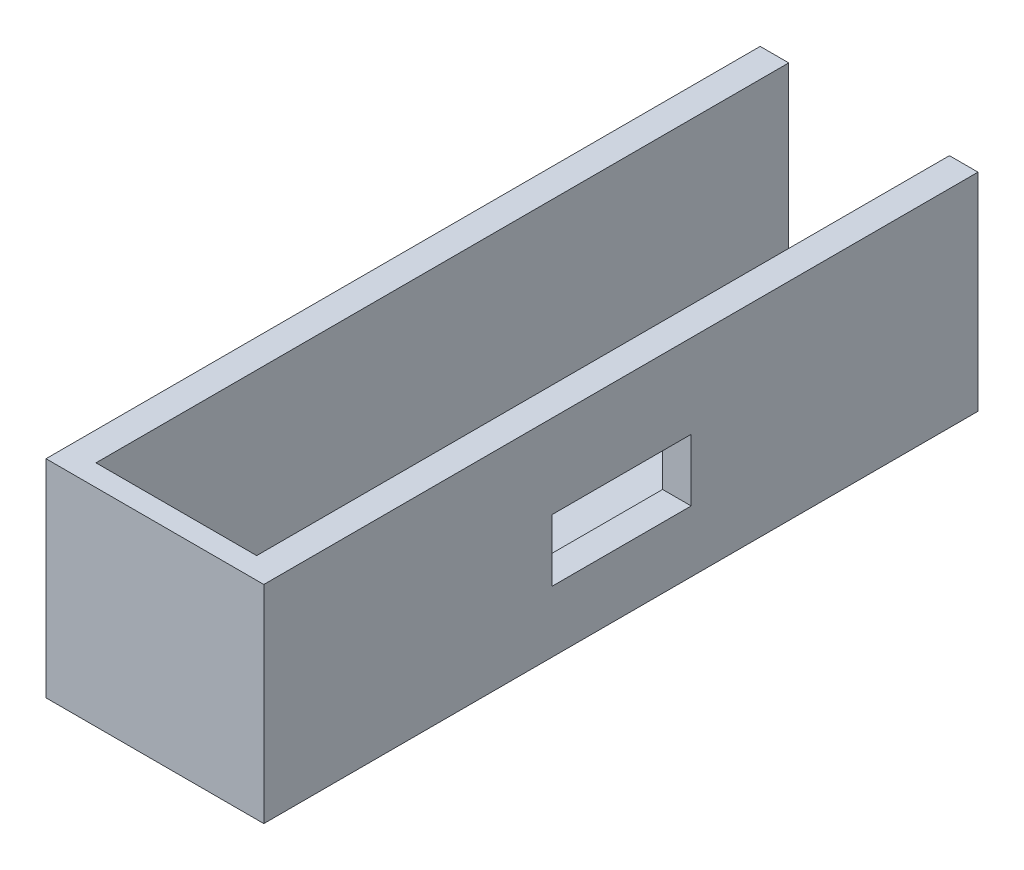
ISO-10303-21;
HEADER;
FILE_DESCRIPTION(('STEP AP214'),'2;1');
FILE_NAME('part.step','',(''),(''),'','','');
FILE_SCHEMA(('AUTOMOTIVE_DESIGN { 1 0 10303 214 1 1 1 1 }'));
ENDSEC;
DATA;
#1=APPLICATION_CONTEXT('core data for automotive mechanical design processes');
#2=APPLICATION_PROTOCOL_DEFINITION('international standard','automotive_design',2000,#1);
#3=PRODUCT_CONTEXT('',#1,'mechanical');
#4=PRODUCT('Part','Part','',(#3));
#5=PRODUCT_RELATED_PRODUCT_CATEGORY('part','',(#4));
#6=PRODUCT_DEFINITION_FORMATION('','',#4);
#7=PRODUCT_DEFINITION_CONTEXT('part definition',#1,'design');
#8=PRODUCT_DEFINITION('design','',#6,#7);
#9=PRODUCT_DEFINITION_SHAPE('','',#8);
#10=(LENGTH_UNIT() NAMED_UNIT(*) SI_UNIT(.MILLI.,.METRE.));
#11=(NAMED_UNIT(*) PLANE_ANGLE_UNIT() SI_UNIT($,.RADIAN.));
#12=(NAMED_UNIT(*) SI_UNIT($,.STERADIAN.) SOLID_ANGLE_UNIT());
#13=UNCERTAINTY_MEASURE_WITH_UNIT(LENGTH_MEASURE(1.E-05),#10,'distance_accuracy_value','');
#14=(GEOMETRIC_REPRESENTATION_CONTEXT(3) GLOBAL_UNCERTAINTY_ASSIGNED_CONTEXT((#13)) GLOBAL_UNIT_ASSIGNED_CONTEXT((#10,
#11,#12)) REPRESENTATION_CONTEXT('',''));
#15=CARTESIAN_POINT('',(0.,0.,0.));
#16=DIRECTION('',(0.,0.,1.));
#17=DIRECTION('',(1.,0.,0.));
#18=AXIS2_PLACEMENT_3D('',#15,#16,#17);
#19=CARTESIAN_POINT('',(12.6513513513514,-25.,50.));
#20=DIRECTION('',(1.,0.,0.));
#21=DIRECTION('',(0.,0.,-1.));
#22=AXIS2_PLACEMENT_3D('',#19,#20,#21);
#23=PLANE('',#22);
#24=DIRECTION('',(0.,-1.,0.));
#25=VECTOR('',#24,1.);
#26=CARTESIAN_POINT('',(12.6513513513514,-25.,47.));
#27=LINE('',#26,#25);
#28=CARTESIAN_POINT('',(12.6513513513514,0.,47.));
#29=VERTEX_POINT('',#28);
#30=CARTESIAN_POINT('',(12.6513513513514,-25.,47.));
#31=VERTEX_POINT('',#30);
#32=EDGE_CURVE('E212',#29,#31,#27,.T.);
#33=ORIENTED_EDGE('',*,*,#32,.F.);
#34=DIRECTION('',(0.,0.,-1.));
#35=VECTOR('',#34,1.);
#36=CARTESIAN_POINT('',(12.6513513513514,0.,50.));
#37=LINE('',#36,#35);
#38=CARTESIAN_POINT('',(12.6513513513514,0.,-50.));
#39=VERTEX_POINT('',#38);
#40=EDGE_CURVE('E166',#29,#39,#37,.T.);
#41=ORIENTED_EDGE('',*,*,#40,.T.);
#42=DIRECTION('',(0.,-1.,0.));
#43=VECTOR('',#42,1.);
#44=CARTESIAN_POINT('',(12.6513513513514,-25.,-50.));
#45=LINE('',#44,#43);
#46=CARTESIAN_POINT('',(12.6513513513514,-25.,-50.));
#47=VERTEX_POINT('',#46);
#48=EDGE_CURVE('E188',#39,#47,#45,.T.);
#49=ORIENTED_EDGE('',*,*,#48,.T.);
#50=DIRECTION('',(0.,0.,-1.));
#51=VECTOR('',#50,1.);
#52=CARTESIAN_POINT('',(12.6513513513514,-25.,50.));
#53=LINE('',#52,#51);
#54=EDGE_CURVE('E169',#31,#47,#53,.T.);
#55=ORIENTED_EDGE('',*,*,#54,.F.);
#56=EDGE_LOOP('',(#33,#41,#49,#55));
#57=FACE_BOUND('',#56,.T.);
#58=DIRECTION('',(0.,-1.,0.));
#59=VECTOR('',#58,1.);
#60=CARTESIAN_POINT('',(12.6513513513514,-25.,-9.83877827761877));
#61=LINE('',#60,#59);
#62=CARTESIAN_POINT('',(12.6513513513514,-11.7079955572935,-9.83877827761876));
#63=VERTEX_POINT('',#62);
#64=CARTESIAN_POINT('',(12.6513513513514,-20.3979955572935,-9.83877827761876));
#65=VERTEX_POINT('',#64);
#66=EDGE_CURVE('E139',#63,#65,#61,.T.);
#67=ORIENTED_EDGE('',*,*,#66,.F.);
#68=DIRECTION('',(0.,0.,-1.));
#69=VECTOR('',#68,1.);
#70=CARTESIAN_POINT('',(12.6513513513514,-11.7079955572935,50.));
#71=LINE('',#70,#69);
#72=CARTESIAN_POINT('',(12.6513513513514,-11.7079955572935,9.66122172238124));
#73=VERTEX_POINT('',#72);
#74=EDGE_CURVE('E236',#73,#63,#71,.T.);
#75=ORIENTED_EDGE('',*,*,#74,.F.);
#76=DIRECTION('',(0.,1.,0.));
#77=VECTOR('',#76,1.);
#78=CARTESIAN_POINT('',(12.6513513513514,-25.,9.66122172238124));
#79=LINE('',#78,#77);
#80=CARTESIAN_POINT('',(12.6513513513514,-20.3979955572935,9.66122172238124));
#81=VERTEX_POINT('',#80);
#82=EDGE_CURVE('E239',#81,#73,#79,.T.);
#83=ORIENTED_EDGE('',*,*,#82,.F.);
#84=DIRECTION('',(0.,0.,1.));
#85=VECTOR('',#84,1.);
#86=CARTESIAN_POINT('',(12.6513513513514,-20.3979955572935,50.));
#87=LINE('',#86,#85);
#88=EDGE_CURVE('E242',#65,#81,#87,.T.);
#89=ORIENTED_EDGE('',*,*,#88,.F.);
#90=EDGE_LOOP('',(#67,#75,#83,#89));
#91=FACE_BOUND('',#90,.T.);
#92=ADVANCED_FACE('F39',(#57,#91),#23,.F.);
#93=CARTESIAN_POINT('',(16.6513513513514,0.,50.));
#94=DIRECTION('',(-1.,0.,0.));
#95=DIRECTION('',(0.,-1.,0.));
#96=AXIS2_PLACEMENT_3D('',#93,#94,#95);
#97=PLANE('',#96);
#98=DIRECTION('',(0.,0.,-1.));
#99=VECTOR('',#98,1.);
#100=CARTESIAN_POINT('',(16.6513513513514,-29.,50.));
#101=LINE('',#100,#99);
#102=CARTESIAN_POINT('',(16.6513513513514,-29.,50.));
#103=VERTEX_POINT('',#102);
#104=CARTESIAN_POINT('',(16.6513513513514,-29.,-50.));
#105=VERTEX_POINT('',#104);
#106=EDGE_CURVE('E160',#103,#105,#101,.T.);
#107=ORIENTED_EDGE('',*,*,#106,.T.);
#108=DIRECTION('',(0.,1.,0.));
#109=VECTOR('',#108,1.);
#110=CARTESIAN_POINT('',(16.6513513513514,0.,-50.));
#111=LINE('',#110,#109);
#112=CARTESIAN_POINT('',(16.6513513513514,0.,-50.));
#113=VERTEX_POINT('',#112);
#114=EDGE_CURVE('E196',#105,#113,#111,.T.);
#115=ORIENTED_EDGE('',*,*,#114,.T.);
#116=DIRECTION('',(0.,0.,-1.));
#117=VECTOR('',#116,1.);
#118=CARTESIAN_POINT('',(16.6513513513514,0.,50.));
#119=LINE('',#118,#117);
#120=CARTESIAN_POINT('',(16.6513513513514,0.,50.));
#121=VERTEX_POINT('',#120);
#122=EDGE_CURVE('E163',#121,#113,#119,.T.);
#123=ORIENTED_EDGE('',*,*,#122,.F.);
#124=DIRECTION('',(0.,1.,0.));
#125=VECTOR('',#124,1.);
#126=CARTESIAN_POINT('',(16.6513513513514,0.,50.));
#127=LINE('',#126,#125);
#128=EDGE_CURVE('E178',#103,#121,#127,.T.);
#129=ORIENTED_EDGE('',*,*,#128,.F.);
#130=EDGE_LOOP('',(#107,#115,#123,#129));
#131=FACE_BOUND('',#130,.T.);
#132=DIRECTION('',(0.,1.,0.));
#133=VECTOR('',#132,1.);
#134=CARTESIAN_POINT('',(16.6513513513514,0.,-9.83877827761877));
#135=LINE('',#134,#133);
#136=CARTESIAN_POINT('',(16.6513513513514,-20.3979955572935,-9.83877827761876));
#137=VERTEX_POINT('',#136);
#138=CARTESIAN_POINT('',(16.6513513513514,-11.7079955572935,-9.83877827761876));
#139=VERTEX_POINT('',#138);
#140=EDGE_CURVE('E11',#137,#139,#135,.T.);
#141=ORIENTED_EDGE('',*,*,#140,.F.);
#142=DIRECTION('',(0.,0.,-1.));
#143=VECTOR('',#142,1.);
#144=CARTESIAN_POINT('',(16.6513513513514,-20.3979955572935,50.));
#145=LINE('',#144,#143);
#146=CARTESIAN_POINT('',(16.6513513513514,-20.3979955572935,9.66122172238124));
#147=VERTEX_POINT('',#146);
#148=EDGE_CURVE('E125',#147,#137,#145,.T.);
#149=ORIENTED_EDGE('',*,*,#148,.F.);
#150=DIRECTION('',(0.,-1.,0.));
#151=VECTOR('',#150,1.);
#152=CARTESIAN_POINT('',(16.6513513513514,0.,9.66122172238124));
#153=LINE('',#152,#151);
#154=CARTESIAN_POINT('',(16.6513513513514,-11.7079955572935,9.66122172238124));
#155=VERTEX_POINT('',#154);
#156=EDGE_CURVE('E131',#155,#147,#153,.T.);
#157=ORIENTED_EDGE('',*,*,#156,.F.);
#158=DIRECTION('',(0.,0.,1.));
#159=VECTOR('',#158,1.);
#160=CARTESIAN_POINT('',(16.6513513513514,-11.7079955572935,50.));
#161=LINE('',#160,#159);
#162=EDGE_CURVE('E48',#139,#155,#161,.T.);
#163=ORIENTED_EDGE('',*,*,#162,.F.);
#164=EDGE_LOOP('',(#141,#149,#157,#163));
#165=FACE_BOUND('',#164,.T.);
#166=ADVANCED_FACE('F144',(#131,#165),#97,.F.);
#167=CARTESIAN_POINT('',(-9.84864864864863,-25.,50.));
#168=DIRECTION('',(0.,-1.,0.));
#169=DIRECTION('',(0.,0.,-1.));
#170=AXIS2_PLACEMENT_3D('',#167,#168,#169);
#171=PLANE('',#170);
#172=DIRECTION('',(-1.,0.,0.));
#173=VECTOR('',#172,1.);
#174=CARTESIAN_POINT('',(-9.84864864864863,-25.,47.));
#175=LINE('',#174,#173);
#176=CARTESIAN_POINT('',(-9.84864864864863,-25.,47.));
#177=VERTEX_POINT('',#176);
#178=EDGE_CURVE('E227',#31,#177,#175,.T.);
#179=ORIENTED_EDGE('',*,*,#178,.F.);
#180=ORIENTED_EDGE('',*,*,#54,.T.);
#181=DIRECTION('',(-1.,0.,0.));
#182=VECTOR('',#181,1.);
#183=CARTESIAN_POINT('',(-9.84864864864863,-25.,-50.));
#184=LINE('',#183,#182);
#185=CARTESIAN_POINT('',(-9.84864864864863,-25.,-50.));
#186=VERTEX_POINT('',#185);
#187=EDGE_CURVE('E184',#47,#186,#184,.T.);
#188=ORIENTED_EDGE('',*,*,#187,.T.);
#189=DIRECTION('',(0.,0.,-1.));
#190=VECTOR('',#189,1.);
#191=CARTESIAN_POINT('',(-9.84864864864863,-25.,50.));
#192=LINE('',#191,#190);
#193=EDGE_CURVE('E172',#177,#186,#192,.T.);
#194=ORIENTED_EDGE('',*,*,#193,.F.);
#195=EDGE_LOOP('',(#179,#180,#188,#194));
#196=FACE_BOUND('',#195,.T.);
#197=ADVANCED_FACE('F273',(#196),#171,.F.);
#198=CARTESIAN_POINT('',(-9.84864864864864,0.,50.));
#199=DIRECTION('',(-1.,0.,0.));
#200=DIRECTION('',(0.,-1.,0.));
#201=AXIS2_PLACEMENT_3D('',#198,#199,#200);
#202=PLANE('',#201);
#203=DIRECTION('',(0.,1.,0.));
#204=VECTOR('',#203,1.);
#205=CARTESIAN_POINT('',(-9.84864864864864,0.,47.));
#206=LINE('',#205,#204);
#207=CARTESIAN_POINT('',(-9.84864864864864,0.,47.));
#208=VERTEX_POINT('',#207);
#209=EDGE_CURVE('E132',#177,#208,#206,.T.);
#210=ORIENTED_EDGE('',*,*,#209,.F.);
#211=ORIENTED_EDGE('',*,*,#193,.T.);
#212=DIRECTION('',(0.,1.,0.));
#213=VECTOR('',#212,1.);
#214=CARTESIAN_POINT('',(-9.84864864864864,0.,-50.));
#215=LINE('',#214,#213);
#216=CARTESIAN_POINT('',(-9.84864864864864,0.,-50.));
#217=VERTEX_POINT('',#216);
#218=EDGE_CURVE('E179',#186,#217,#215,.T.);
#219=ORIENTED_EDGE('',*,*,#218,.T.);
#220=DIRECTION('',(0.,0.,-1.));
#221=VECTOR('',#220,1.);
#222=CARTESIAN_POINT('',(-9.84864864864864,0.,50.));
#223=LINE('',#222,#221);
#224=EDGE_CURVE('E175',#208,#217,#223,.T.);
#225=ORIENTED_EDGE('',*,*,#224,.F.);
#226=EDGE_LOOP('',(#210,#211,#219,#225));
#227=FACE_BOUND('',#226,.T.);
#228=ADVANCED_FACE('F290',(#227),#202,.F.);
#229=CARTESIAN_POINT('',(-13.8486486486486,-29.,50.));
#230=DIRECTION('',(1.,0.,0.));
#231=DIRECTION('',(0.,1.,0.));
#232=AXIS2_PLACEMENT_3D('',#229,#230,#231);
#233=PLANE('',#232);
#234=DIRECTION('',(0.,0.,-1.));
#235=VECTOR('',#234,1.);
#236=CARTESIAN_POINT('',(-13.8486486486486,0.,50.));
#237=LINE('',#236,#235);
#238=CARTESIAN_POINT('',(-13.8486486486486,0.,50.));
#239=VERTEX_POINT('',#238);
#240=CARTESIAN_POINT('',(-13.8486486486486,0.,-50.));
#241=VERTEX_POINT('',#240);
#242=EDGE_CURVE('E154',#239,#241,#237,.T.);
#243=ORIENTED_EDGE('',*,*,#242,.T.);
#244=DIRECTION('',(0.,-1.,0.));
#245=VECTOR('',#244,1.);
#246=CARTESIAN_POINT('',(-13.8486486486486,-29.,-50.));
#247=LINE('',#246,#245);
#248=CARTESIAN_POINT('',(-13.8486486486486,-29.,-50.));
#249=VERTEX_POINT('',#248);
#250=EDGE_CURVE('E204',#241,#249,#247,.T.);
#251=ORIENTED_EDGE('',*,*,#250,.T.);
#252=DIRECTION('',(0.,0.,-1.));
#253=VECTOR('',#252,1.);
#254=CARTESIAN_POINT('',(-13.8486486486486,-29.,50.));
#255=LINE('',#254,#253);
#256=CARTESIAN_POINT('',(-13.8486486486486,-29.,50.));
#257=VERTEX_POINT('',#256);
#258=EDGE_CURVE('E157',#257,#249,#255,.T.);
#259=ORIENTED_EDGE('',*,*,#258,.F.);
#260=DIRECTION('',(0.,-1.,0.));
#261=VECTOR('',#260,1.);
#262=CARTESIAN_POINT('',(-13.8486486486486,-29.,50.));
#263=LINE('',#262,#261);
#264=EDGE_CURVE('E219',#239,#257,#263,.T.);
#265=ORIENTED_EDGE('',*,*,#264,.F.);
#266=EDGE_LOOP('',(#243,#251,#259,#265));
#267=FACE_BOUND('',#266,.T.);
#268=ADVANCED_FACE('F41',(#267),#233,.F.);
#269=CARTESIAN_POINT('',(16.6513513513514,-29.,50.));
#270=DIRECTION('',(0.,1.,0.));
#271=DIRECTION('',(-1.,0.,0.));
#272=AXIS2_PLACEMENT_3D('',#269,#270,#271);
#273=PLANE('',#272);
#274=ORIENTED_EDGE('',*,*,#258,.T.);
#275=DIRECTION('',(1.,0.,0.));
#276=VECTOR('',#275,1.);
#277=CARTESIAN_POINT('',(16.6513513513514,-29.,-50.));
#278=LINE('',#277,#276);
#279=EDGE_CURVE('E200',#249,#105,#278,.T.);
#280=ORIENTED_EDGE('',*,*,#279,.T.);
#281=ORIENTED_EDGE('',*,*,#106,.F.);
#282=DIRECTION('',(1.,0.,0.));
#283=VECTOR('',#282,1.);
#284=CARTESIAN_POINT('',(16.6513513513514,-29.,50.));
#285=LINE('',#284,#283);
#286=EDGE_CURVE('E216',#257,#103,#285,.T.);
#287=ORIENTED_EDGE('',*,*,#286,.F.);
#288=EDGE_LOOP('',(#274,#280,#281,#287));
#289=FACE_BOUND('',#288,.T.);
#290=ADVANCED_FACE('F283',(#289),#273,.F.);
#291=CARTESIAN_POINT('',(12.6513513513514,0.,50.));
#292=DIRECTION('',(0.,-1.,0.));
#293=DIRECTION('',(0.,0.,-1.));
#294=AXIS2_PLACEMENT_3D('',#291,#292,#293);
#295=PLANE('',#294);
#296=ORIENTED_EDGE('',*,*,#122,.T.);
#297=DIRECTION('',(-1.,0.,0.));
#298=VECTOR('',#297,1.);
#299=CARTESIAN_POINT('',(12.6513513513514,0.,-50.));
#300=LINE('',#299,#298);
#301=EDGE_CURVE('E192',#113,#39,#300,.T.);
#302=ORIENTED_EDGE('',*,*,#301,.T.);
#303=ORIENTED_EDGE('',*,*,#40,.F.);
#304=DIRECTION('',(-1.,0.,0.));
#305=VECTOR('',#304,1.);
#306=CARTESIAN_POINT('',(-13.8486486486486,0.,47.));
#307=LINE('',#306,#305);
#308=EDGE_CURVE('E230',#29,#208,#307,.T.);
#309=ORIENTED_EDGE('',*,*,#308,.T.);
#310=ORIENTED_EDGE('',*,*,#224,.T.);
#311=DIRECTION('',(-1.,0.,0.));
#312=VECTOR('',#311,1.);
#313=CARTESIAN_POINT('',(-13.8486486486486,0.,-50.));
#314=LINE('',#313,#312);
#315=EDGE_CURVE('E208',#217,#241,#314,.T.);
#316=ORIENTED_EDGE('',*,*,#315,.T.);
#317=ORIENTED_EDGE('',*,*,#242,.F.);
#318=DIRECTION('',(-1.,0.,0.));
#319=VECTOR('',#318,1.);
#320=CARTESIAN_POINT('',(-13.8486486486486,0.,50.));
#321=LINE('',#320,#319);
#322=EDGE_CURVE('E183',#121,#239,#321,.T.);
#323=ORIENTED_EDGE('',*,*,#322,.F.);
#324=EDGE_LOOP('',(#296,#302,#303,#309,#310,#316,#317,#323));
#325=FACE_BOUND('',#324,.T.);
#326=ADVANCED_FACE('F280',(#325),#295,.F.);
#327=CARTESIAN_POINT('',(0.,0.,50.));
#328=DIRECTION('',(0.,0.,-1.));
#329=DIRECTION('',(-1.,0.,0.));
#330=AXIS2_PLACEMENT_3D('',#327,#328,#329);
#331=PLANE('',#330);
#332=ORIENTED_EDGE('',*,*,#322,.T.);
#333=ORIENTED_EDGE('',*,*,#264,.T.);
#334=ORIENTED_EDGE('',*,*,#286,.T.);
#335=ORIENTED_EDGE('',*,*,#128,.T.);
#336=EDGE_LOOP('',(#332,#333,#334,#335));
#337=FACE_BOUND('',#336,.T.);
#338=ADVANCED_FACE('F282',(#337),#331,.F.);
#339=CARTESIAN_POINT('',(0.,0.,-50.));
#340=DIRECTION('',(0.,0.,-1.));
#341=DIRECTION('',(-1.,0.,0.));
#342=AXIS2_PLACEMENT_3D('',#339,#340,#341);
#343=PLANE('',#342);
#344=ORIENTED_EDGE('',*,*,#315,.F.);
#345=ORIENTED_EDGE('',*,*,#218,.F.);
#346=ORIENTED_EDGE('',*,*,#187,.F.);
#347=ORIENTED_EDGE('',*,*,#48,.F.);
#348=ORIENTED_EDGE('',*,*,#301,.F.);
#349=ORIENTED_EDGE('',*,*,#114,.F.);
#350=ORIENTED_EDGE('',*,*,#279,.F.);
#351=ORIENTED_EDGE('',*,*,#250,.F.);
#352=EDGE_LOOP('',(#344,#345,#346,#347,#348,#349,#350,#351));
#353=FACE_BOUND('',#352,.T.);
#354=ADVANCED_FACE('F301',(#353),#343,.T.);
#355=CARTESIAN_POINT('',(0.,0.,47.));
#356=DIRECTION('',(0.,0.,1.));
#357=DIRECTION('',(1.,0.,0.));
#358=AXIS2_PLACEMENT_3D('',#355,#356,#357);
#359=PLANE('',#358);
#360=ORIENTED_EDGE('',*,*,#308,.F.);
#361=ORIENTED_EDGE('',*,*,#32,.T.);
#362=ORIENTED_EDGE('',*,*,#178,.T.);
#363=ORIENTED_EDGE('',*,*,#209,.T.);
#364=EDGE_LOOP('',(#360,#361,#362,#363));
#365=FACE_BOUND('',#364,.T.);
#366=ADVANCED_FACE('F265',(#365),#359,.F.);
#367=CARTESIAN_POINT('',(30.,-20.3979955572935,-9.83877827761876));
#368=DIRECTION('',(0.,0.,1.));
#369=DIRECTION('',(1.,0.,0.));
#370=AXIS2_PLACEMENT_3D('',#367,#368,#369);
#371=PLANE('',#370);
#372=ORIENTED_EDGE('',*,*,#66,.T.);
#373=DIRECTION('',(-1.,0.,0.));
#374=VECTOR('',#373,1.);
#375=CARTESIAN_POINT('',(30.,-20.3979955572935,-9.83877827761876));
#376=LINE('',#375,#374);
#377=EDGE_CURVE('E55',#137,#65,#376,.T.);
#378=ORIENTED_EDGE('',*,*,#377,.F.);
#379=ORIENTED_EDGE('',*,*,#140,.T.);
#380=DIRECTION('',(-1.,0.,0.));
#381=VECTOR('',#380,1.);
#382=CARTESIAN_POINT('',(30.,-11.7079955572935,-9.83877827761876));
#383=LINE('',#382,#381);
#384=EDGE_CURVE('E245',#139,#63,#383,.T.);
#385=ORIENTED_EDGE('',*,*,#384,.T.);
#386=EDGE_LOOP('',(#372,#378,#379,#385));
#387=FACE_BOUND('',#386,.T.);
#388=ADVANCED_FACE('F135',(#387),#371,.T.);
#389=CARTESIAN_POINT('',(30.,-11.7079955572935,9.66122172238124));
#390=DIRECTION('',(0.,-1.,0.));
#391=DIRECTION('',(0.,0.,-1.));
#392=AXIS2_PLACEMENT_3D('',#389,#390,#391);
#393=PLANE('',#392);
#394=ORIENTED_EDGE('',*,*,#74,.T.);
#395=ORIENTED_EDGE('',*,*,#384,.F.);
#396=ORIENTED_EDGE('',*,*,#162,.T.);
#397=DIRECTION('',(-1.,0.,0.));
#398=VECTOR('',#397,1.);
#399=CARTESIAN_POINT('',(30.,-11.7079955572935,9.66122172238124));
#400=LINE('',#399,#398);
#401=EDGE_CURVE('E248',#155,#73,#400,.T.);
#402=ORIENTED_EDGE('',*,*,#401,.T.);
#403=EDGE_LOOP('',(#394,#395,#396,#402));
#404=FACE_BOUND('',#403,.T.);
#405=ADVANCED_FACE('F257',(#404),#393,.T.);
#406=CARTESIAN_POINT('',(30.,-20.3979955572935,9.66122172238124));
#407=DIRECTION('',(0.,0.,-1.));
#408=DIRECTION('',(-1.,0.,0.));
#409=AXIS2_PLACEMENT_3D('',#406,#407,#408);
#410=PLANE('',#409);
#411=ORIENTED_EDGE('',*,*,#82,.T.);
#412=ORIENTED_EDGE('',*,*,#401,.F.);
#413=ORIENTED_EDGE('',*,*,#156,.T.);
#414=DIRECTION('',(-1.,0.,0.));
#415=VECTOR('',#414,1.);
#416=CARTESIAN_POINT('',(30.,-20.3979955572935,9.66122172238124));
#417=LINE('',#416,#415);
#418=EDGE_CURVE('E60',#147,#81,#417,.T.);
#419=ORIENTED_EDGE('',*,*,#418,.T.);
#420=EDGE_LOOP('',(#411,#412,#413,#419));
#421=FACE_BOUND('',#420,.T.);
#422=ADVANCED_FACE('F254',(#421),#410,.T.);
#423=CARTESIAN_POINT('',(30.,-20.3979955572935,9.66122172238124));
#424=DIRECTION('',(0.,1.,0.));
#425=DIRECTION('',(0.,0.,1.));
#426=AXIS2_PLACEMENT_3D('',#423,#424,#425);
#427=PLANE('',#426);
#428=ORIENTED_EDGE('',*,*,#88,.T.);
#429=ORIENTED_EDGE('',*,*,#418,.F.);
#430=ORIENTED_EDGE('',*,*,#148,.T.);
#431=ORIENTED_EDGE('',*,*,#377,.T.);
#432=EDGE_LOOP('',(#428,#429,#430,#431));
#433=FACE_BOUND('',#432,.T.);
#434=ADVANCED_FACE('F126',(#433),#427,.T.);
#435=CLOSED_SHELL('',(#92,#166,#197,#228,#268,#290,#326,#338,#354,#366,#388,#405,#422,#434));
#436=MANIFOLD_SOLID_BREP('B2',#435);
#437=ADVANCED_BREP_SHAPE_REPRESENTATION('',(#18,#436),#14);
#438=SHAPE_DEFINITION_REPRESENTATION(#9,#437);
ENDSEC;
END-ISO-10303-21;
